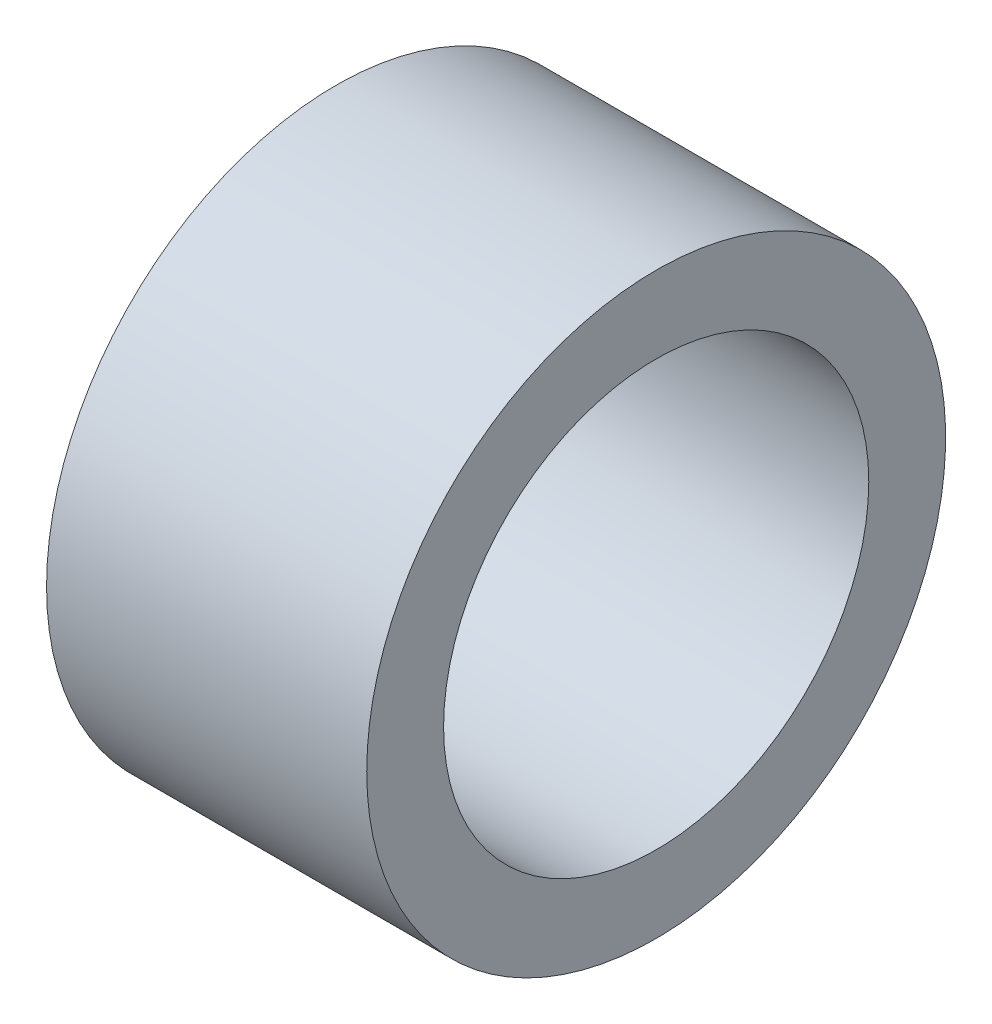
ISO-10303-21;
HEADER;
FILE_DESCRIPTION(('STEP AP214'),'2;1');
FILE_NAME('part.step','',(''),(''),'','','');
FILE_SCHEMA(('AUTOMOTIVE_DESIGN { 1 0 10303 214 1 1 1 1 }'));
ENDSEC;
DATA;
#1=APPLICATION_CONTEXT('core data for automotive mechanical design processes');
#2=APPLICATION_PROTOCOL_DEFINITION('international standard','automotive_design',2000,#1);
#3=PRODUCT_CONTEXT('',#1,'mechanical');
#4=PRODUCT('Part','Part','',(#3));
#5=PRODUCT_RELATED_PRODUCT_CATEGORY('part','',(#4));
#6=PRODUCT_DEFINITION_FORMATION('','',#4);
#7=PRODUCT_DEFINITION_CONTEXT('part definition',#1,'design');
#8=PRODUCT_DEFINITION('design','',#6,#7);
#9=PRODUCT_DEFINITION_SHAPE('','',#8);
#10=(LENGTH_UNIT() NAMED_UNIT(*) SI_UNIT(.MILLI.,.METRE.));
#11=(NAMED_UNIT(*) PLANE_ANGLE_UNIT() SI_UNIT($,.RADIAN.));
#12=(NAMED_UNIT(*) SI_UNIT($,.STERADIAN.) SOLID_ANGLE_UNIT());
#13=UNCERTAINTY_MEASURE_WITH_UNIT(LENGTH_MEASURE(1.E-05),#10,'distance_accuracy_value','');
#14=(GEOMETRIC_REPRESENTATION_CONTEXT(3) GLOBAL_UNCERTAINTY_ASSIGNED_CONTEXT((#13)) GLOBAL_UNIT_ASSIGNED_CONTEXT((#10,
#11,#12)) REPRESENTATION_CONTEXT('',''));
#15=CARTESIAN_POINT('',(0.,0.,0.));
#16=DIRECTION('',(0.,0.,1.));
#17=DIRECTION('',(1.,0.,0.));
#18=AXIS2_PLACEMENT_3D('',#15,#16,#17);
#19=CARTESIAN_POINT('',(6.25,0.,0.));
#20=DIRECTION('',(-1.,0.,0.));
#21=DIRECTION('',(0.,0.,1.));
#22=AXIS2_PLACEMENT_3D('',#19,#20,#21);
#23=PLANE('',#22);
#24=CARTESIAN_POINT('',(6.25,0.,0.));
#25=DIRECTION('',(-1.,0.,0.));
#26=DIRECTION('',(0.,0.,1.));
#27=AXIS2_PLACEMENT_3D('',#24,#25,#26);
#28=CIRCLE('',#27,5.65);
#29=CARTESIAN_POINT('',(6.25,0.,5.65));
#30=VERTEX_POINT('',#29);
#31=EDGE_CURVE('E51',#30,#30,#28,.T.);
#32=ORIENTED_EDGE('',*,*,#31,.F.);
#33=EDGE_LOOP('',(#32));
#34=FACE_BOUND('',#33,.T.);
#35=CARTESIAN_POINT('',(6.25,0.,0.));
#36=DIRECTION('',(-1.,0.,0.));
#37=DIRECTION('',(0.,0.,1.));
#38=AXIS2_PLACEMENT_3D('',#35,#36,#37);
#39=CIRCLE('',#38,4.15);
#40=CARTESIAN_POINT('',(6.25,0.,4.15));
#41=VERTEX_POINT('',#40);
#42=EDGE_CURVE('E10',#41,#41,#39,.T.);
#43=ORIENTED_EDGE('',*,*,#42,.T.);
#44=EDGE_LOOP('',(#43));
#45=FACE_BOUND('',#44,.T.);
#46=ADVANCED_FACE('F37',(#34,#45),#23,.F.);
#47=CARTESIAN_POINT('',(0.,0.,0.));
#48=DIRECTION('',(-1.,0.,0.));
#49=DIRECTION('',(0.,0.,1.));
#50=AXIS2_PLACEMENT_3D('',#47,#48,#49);
#51=CYLINDRICAL_SURFACE('',#50,4.15);
#52=ORIENTED_EDGE('',*,*,#42,.F.);
#53=EDGE_LOOP('',(#52));
#54=FACE_BOUND('',#53,.T.);
#55=CARTESIAN_POINT('',(0.,0.,0.));
#56=DIRECTION('',(-1.,0.,0.));
#57=DIRECTION('',(0.,0.,1.));
#58=AXIS2_PLACEMENT_3D('',#55,#56,#57);
#59=CIRCLE('',#58,4.15);
#60=CARTESIAN_POINT('',(0.,0.,4.15));
#61=VERTEX_POINT('',#60);
#62=EDGE_CURVE('E43',#61,#61,#59,.T.);
#63=ORIENTED_EDGE('',*,*,#62,.T.);
#64=EDGE_LOOP('',(#63));
#65=FACE_BOUND('',#64,.T.);
#66=ADVANCED_FACE('F61',(#54,#65),#51,.F.);
#67=CARTESIAN_POINT('',(0.,0.,0.));
#68=DIRECTION('',(-1.,0.,0.));
#69=DIRECTION('',(0.,0.,1.));
#70=AXIS2_PLACEMENT_3D('',#67,#68,#69);
#71=PLANE('',#70);
#72=CARTESIAN_POINT('',(0.,0.,0.));
#73=DIRECTION('',(-1.,0.,0.));
#74=DIRECTION('',(0.,0.,1.));
#75=AXIS2_PLACEMENT_3D('',#72,#73,#74);
#76=CIRCLE('',#75,5.65);
#77=CARTESIAN_POINT('',(0.,0.,5.65));
#78=VERTEX_POINT('',#77);
#79=EDGE_CURVE('E47',#78,#78,#76,.T.);
#80=ORIENTED_EDGE('',*,*,#79,.T.);
#81=EDGE_LOOP('',(#80));
#82=FACE_BOUND('',#81,.T.);
#83=ORIENTED_EDGE('',*,*,#62,.F.);
#84=EDGE_LOOP('',(#83));
#85=FACE_BOUND('',#84,.T.);
#86=ADVANCED_FACE('F65',(#82,#85),#71,.T.);
#87=CARTESIAN_POINT('',(0.,0.,0.));
#88=DIRECTION('',(-1.,0.,0.));
#89=DIRECTION('',(0.,0.,1.));
#90=AXIS2_PLACEMENT_3D('',#87,#88,#89);
#91=CYLINDRICAL_SURFACE('',#90,5.65);
#92=ORIENTED_EDGE('',*,*,#31,.T.);
#93=EDGE_LOOP('',(#92));
#94=FACE_BOUND('',#93,.T.);
#95=ORIENTED_EDGE('',*,*,#79,.F.);
#96=EDGE_LOOP('',(#95));
#97=FACE_BOUND('',#96,.T.);
#98=ADVANCED_FACE('F57',(#94,#97),#91,.T.);
#99=CLOSED_SHELL('',(#46,#66,#86,#98));
#100=MANIFOLD_SOLID_BREP('B2',#99);
#101=ADVANCED_BREP_SHAPE_REPRESENTATION('',(#18,#100),#14);
#102=SHAPE_DEFINITION_REPRESENTATION(#9,#101);
ENDSEC;
END-ISO-10303-21;
